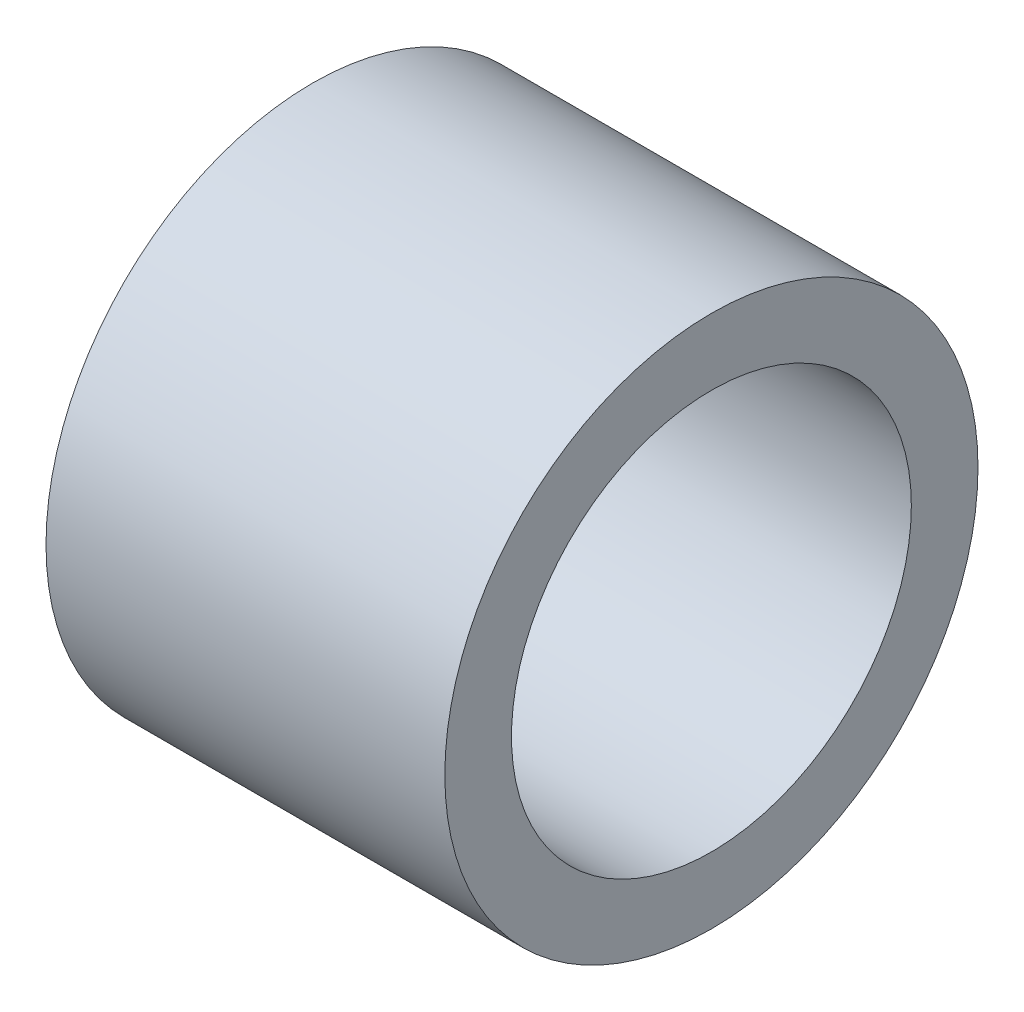
ISO-10303-21;
HEADER;
FILE_DESCRIPTION(('STEP AP214'),'2;1');
FILE_NAME('part.step','',(''),(''),'','','');
FILE_SCHEMA(('AUTOMOTIVE_DESIGN { 1 0 10303 214 1 1 1 1 }'));
ENDSEC;
DATA;
#1=APPLICATION_CONTEXT('core data for automotive mechanical design processes');
#2=APPLICATION_PROTOCOL_DEFINITION('international standard','automotive_design',2000,#1);
#3=PRODUCT_CONTEXT('',#1,'mechanical');
#4=PRODUCT('Part','Part','',(#3));
#5=PRODUCT_RELATED_PRODUCT_CATEGORY('part','',(#4));
#6=PRODUCT_DEFINITION_FORMATION('','',#4);
#7=PRODUCT_DEFINITION_CONTEXT('part definition',#1,'design');
#8=PRODUCT_DEFINITION('design','',#6,#7);
#9=PRODUCT_DEFINITION_SHAPE('','',#8);
#10=(LENGTH_UNIT() NAMED_UNIT(*) SI_UNIT(.MILLI.,.METRE.));
#11=(NAMED_UNIT(*) PLANE_ANGLE_UNIT() SI_UNIT($,.RADIAN.));
#12=(NAMED_UNIT(*) SI_UNIT($,.STERADIAN.) SOLID_ANGLE_UNIT());
#13=UNCERTAINTY_MEASURE_WITH_UNIT(LENGTH_MEASURE(1.E-05),#10,'distance_accuracy_value','');
#14=(GEOMETRIC_REPRESENTATION_CONTEXT(3) GLOBAL_UNCERTAINTY_ASSIGNED_CONTEXT((#13)) GLOBAL_UNIT_ASSIGNED_CONTEXT((#10,
#11,#12)) REPRESENTATION_CONTEXT('',''));
#15=CARTESIAN_POINT('',(0.,0.,0.));
#16=DIRECTION('',(0.,0.,1.));
#17=DIRECTION('',(1.,0.,0.));
#18=AXIS2_PLACEMENT_3D('',#15,#16,#17);
#19=CARTESIAN_POINT('',(-9.5,0.,0.));
#20=DIRECTION('',(1.,0.,0.));
#21=DIRECTION('',(0.,0.,-1.));
#22=AXIS2_PLACEMENT_3D('',#19,#20,#21);
#23=CYLINDRICAL_SURFACE('',#22,12.7);
#24=CARTESIAN_POINT('',(-9.5,0.,0.));
#25=DIRECTION('',(1.,0.,0.));
#26=DIRECTION('',(0.,0.,-1.));
#27=AXIS2_PLACEMENT_3D('',#24,#25,#26);
#28=CIRCLE('',#27,12.7);
#29=CARTESIAN_POINT('',(-9.5,0.,-12.7));
#30=VERTEX_POINT('',#29);
#31=EDGE_CURVE('E10',#30,#30,#28,.T.);
#32=ORIENTED_EDGE('',*,*,#31,.T.);
#33=EDGE_LOOP('',(#32));
#34=FACE_BOUND('',#33,.T.);
#35=CARTESIAN_POINT('',(9.5,0.,0.));
#36=DIRECTION('',(1.,0.,0.));
#37=DIRECTION('',(0.,0.,-1.));
#38=AXIS2_PLACEMENT_3D('',#35,#36,#37);
#39=CIRCLE('',#38,12.7);
#40=CARTESIAN_POINT('',(9.5,0.,-12.7));
#41=VERTEX_POINT('',#40);
#42=EDGE_CURVE('E40',#41,#41,#39,.T.);
#43=ORIENTED_EDGE('',*,*,#42,.F.);
#44=EDGE_LOOP('',(#43));
#45=FACE_BOUND('',#44,.T.);
#46=ADVANCED_FACE('F37',(#34,#45),#23,.T.);
#47=CARTESIAN_POINT('',(-9.5,0.,0.));
#48=DIRECTION('',(1.,0.,0.));
#49=DIRECTION('',(0.,0.,-1.));
#50=AXIS2_PLACEMENT_3D('',#47,#48,#49);
#51=PLANE('',#50);
#52=CARTESIAN_POINT('',(-9.5,0.,0.));
#53=DIRECTION('',(1.,0.,0.));
#54=DIRECTION('',(0.,0.,-1.));
#55=AXIS2_PLACEMENT_3D('',#52,#53,#54);
#56=CIRCLE('',#55,9.525);
#57=CARTESIAN_POINT('',(-9.5,0.,-9.525));
#58=VERTEX_POINT('',#57);
#59=EDGE_CURVE('E47',#58,#58,#56,.T.);
#60=ORIENTED_EDGE('',*,*,#59,.T.);
#61=EDGE_LOOP('',(#60));
#62=FACE_BOUND('',#61,.T.);
#63=ORIENTED_EDGE('',*,*,#31,.F.);
#64=EDGE_LOOP('',(#63));
#65=FACE_BOUND('',#64,.T.);
#66=ADVANCED_FACE('F55',(#62,#65),#51,.F.);
#67=CARTESIAN_POINT('',(9.5,0.,0.));
#68=DIRECTION('',(1.,0.,0.));
#69=DIRECTION('',(0.,0.,-1.));
#70=AXIS2_PLACEMENT_3D('',#67,#68,#69);
#71=PLANE('',#70);
#72=CARTESIAN_POINT('',(9.5,0.,0.));
#73=DIRECTION('',(1.,0.,0.));
#74=DIRECTION('',(0.,0.,-1.));
#75=AXIS2_PLACEMENT_3D('',#72,#73,#74);
#76=CIRCLE('',#75,9.525);
#77=CARTESIAN_POINT('',(9.5,0.,-9.525));
#78=VERTEX_POINT('',#77);
#79=EDGE_CURVE('E49',#78,#78,#76,.T.);
#80=ORIENTED_EDGE('',*,*,#79,.F.);
#81=EDGE_LOOP('',(#80));
#82=FACE_BOUND('',#81,.T.);
#83=ORIENTED_EDGE('',*,*,#42,.T.);
#84=EDGE_LOOP('',(#83));
#85=FACE_BOUND('',#84,.T.);
#86=ADVANCED_FACE('F61',(#82,#85),#71,.T.);
#87=CARTESIAN_POINT('',(-9.5,0.,0.));
#88=DIRECTION('',(1.,0.,0.));
#89=DIRECTION('',(0.,0.,-1.));
#90=AXIS2_PLACEMENT_3D('',#87,#88,#89);
#91=CYLINDRICAL_SURFACE('',#90,9.525);
#92=ORIENTED_EDGE('',*,*,#59,.F.);
#93=EDGE_LOOP('',(#92));
#94=FACE_BOUND('',#93,.T.);
#95=ORIENTED_EDGE('',*,*,#79,.T.);
#96=EDGE_LOOP('',(#95));
#97=FACE_BOUND('',#96,.T.);
#98=ADVANCED_FACE('F58',(#94,#97),#91,.F.);
#99=CLOSED_SHELL('',(#46,#66,#86,#98));
#100=MANIFOLD_SOLID_BREP('B2',#99);
#101=ADVANCED_BREP_SHAPE_REPRESENTATION('',(#18,#100),#14);
#102=SHAPE_DEFINITION_REPRESENTATION(#9,#101);
ENDSEC;
END-ISO-10303-21;
